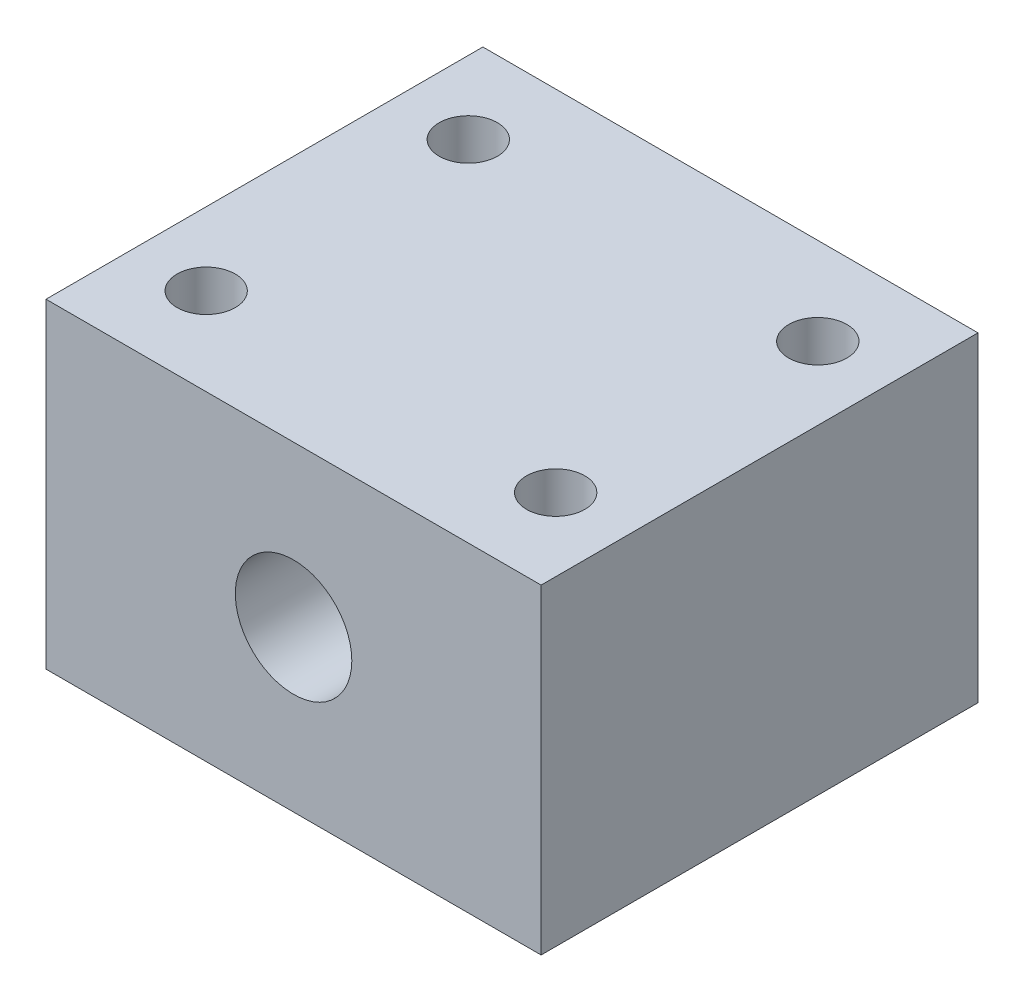
ISO-10303-21;
HEADER;
FILE_DESCRIPTION(('STEP AP214'),'2;1');
FILE_NAME('part.step','',(''),(''),'','','');
FILE_SCHEMA(('AUTOMOTIVE_DESIGN { 1 0 10303 214 1 1 1 1 }'));
ENDSEC;
DATA;
#1=APPLICATION_CONTEXT('core data for automotive mechanical design processes');
#2=APPLICATION_PROTOCOL_DEFINITION('international standard','automotive_design',2000,#1);
#3=PRODUCT_CONTEXT('',#1,'mechanical');
#4=PRODUCT('Part','Part','',(#3));
#5=PRODUCT_RELATED_PRODUCT_CATEGORY('part','',(#4));
#6=PRODUCT_DEFINITION_FORMATION('','',#4);
#7=PRODUCT_DEFINITION_CONTEXT('part definition',#1,'design');
#8=PRODUCT_DEFINITION('design','',#6,#7);
#9=PRODUCT_DEFINITION_SHAPE('','',#8);
#10=(LENGTH_UNIT() NAMED_UNIT(*) SI_UNIT(.MILLI.,.METRE.));
#11=(NAMED_UNIT(*) PLANE_ANGLE_UNIT() SI_UNIT($,.RADIAN.));
#12=(NAMED_UNIT(*) SI_UNIT($,.STERADIAN.) SOLID_ANGLE_UNIT());
#13=UNCERTAINTY_MEASURE_WITH_UNIT(LENGTH_MEASURE(1.E-05),#10,'distance_accuracy_value','');
#14=(GEOMETRIC_REPRESENTATION_CONTEXT(3) GLOBAL_UNCERTAINTY_ASSIGNED_CONTEXT((#13)) GLOBAL_UNIT_ASSIGNED_CONTEXT((#10,
#11,#12)) REPRESENTATION_CONTEXT('',''));
#15=CARTESIAN_POINT('',(0.,0.,0.));
#16=DIRECTION('',(0.,0.,1.));
#17=DIRECTION('',(1.,0.,0.));
#18=AXIS2_PLACEMENT_3D('',#15,#16,#17);
#19=CARTESIAN_POINT('',(0.,0.,30.));
#20=DIRECTION('',(0.,0.,-1.));
#21=DIRECTION('',(-1.,0.,0.));
#22=AXIS2_PLACEMENT_3D('',#19,#20,#21);
#23=PLANE('',#22);
#24=DIRECTION('',(0.,-1.,0.));
#25=VECTOR('',#24,1.);
#26=CARTESIAN_POINT('',(0.,0.,30.));
#27=LINE('',#26,#25);
#28=CARTESIAN_POINT('',(0.,22.,30.));
#29=VERTEX_POINT('',#28);
#30=CARTESIAN_POINT('',(0.,0.,30.));
#31=VERTEX_POINT('',#30);
#32=EDGE_CURVE('E84',#29,#31,#27,.T.);
#33=ORIENTED_EDGE('',*,*,#32,.T.);
#34=DIRECTION('',(1.,0.,0.));
#35=VECTOR('',#34,1.);
#36=CARTESIAN_POINT('',(0.,0.,30.));
#37=LINE('',#36,#35);
#38=CARTESIAN_POINT('',(34.,0.,30.));
#39=VERTEX_POINT('',#38);
#40=EDGE_CURVE('E79',#31,#39,#37,.T.);
#41=ORIENTED_EDGE('',*,*,#40,.T.);
#42=DIRECTION('',(0.,1.,0.));
#43=VECTOR('',#42,1.);
#44=CARTESIAN_POINT('',(34.,0.,30.));
#45=LINE('',#44,#43);
#46=CARTESIAN_POINT('',(34.,22.,30.));
#47=VERTEX_POINT('',#46);
#48=EDGE_CURVE('E82',#39,#47,#45,.T.);
#49=ORIENTED_EDGE('',*,*,#48,.T.);
#50=DIRECTION('',(-1.,0.,0.));
#51=VECTOR('',#50,1.);
#52=CARTESIAN_POINT('',(0.,22.,30.));
#53=LINE('',#52,#51);
#54=EDGE_CURVE('E49',#47,#29,#53,.T.);
#55=ORIENTED_EDGE('',*,*,#54,.T.);
#56=EDGE_LOOP('',(#33,#41,#49,#55));
#57=FACE_BOUND('',#56,.T.);
#58=CARTESIAN_POINT('',(17.,11.,30.));
#59=DIRECTION('',(0.,0.,1.));
#60=DIRECTION('',(1.,0.,0.));
#61=AXIS2_PLACEMENT_3D('',#58,#59,#60);
#62=CIRCLE('',#61,4.);
#63=CARTESIAN_POINT('',(21.,11.,30.));
#64=VERTEX_POINT('',#63);
#65=EDGE_CURVE('E99',#64,#64,#62,.T.);
#66=ORIENTED_EDGE('',*,*,#65,.F.);
#67=EDGE_LOOP('',(#66));
#68=FACE_BOUND('',#67,.T.);
#69=ADVANCED_FACE('F32',(#57,#68),#23,.F.);
#70=CARTESIAN_POINT('',(0.,0.,0.));
#71=DIRECTION('',(0.,0.,-1.));
#72=DIRECTION('',(-1.,0.,0.));
#73=AXIS2_PLACEMENT_3D('',#70,#71,#72);
#74=PLANE('',#73);
#75=DIRECTION('',(0.,-1.,0.));
#76=VECTOR('',#75,1.);
#77=CARTESIAN_POINT('',(0.,0.,0.));
#78=LINE('',#77,#76);
#79=CARTESIAN_POINT('',(0.,22.,0.));
#80=VERTEX_POINT('',#79);
#81=CARTESIAN_POINT('',(0.,0.,0.));
#82=VERTEX_POINT('',#81);
#83=EDGE_CURVE('E96',#80,#82,#78,.T.);
#84=ORIENTED_EDGE('',*,*,#83,.F.);
#85=DIRECTION('',(-1.,0.,0.));
#86=VECTOR('',#85,1.);
#87=CARTESIAN_POINT('',(0.,22.,0.));
#88=LINE('',#87,#86);
#89=CARTESIAN_POINT('',(34.,22.,0.));
#90=VERTEX_POINT('',#89);
#91=EDGE_CURVE('E72',#90,#80,#88,.T.);
#92=ORIENTED_EDGE('',*,*,#91,.F.);
#93=DIRECTION('',(0.,1.,0.));
#94=VECTOR('',#93,1.);
#95=CARTESIAN_POINT('',(34.,0.,0.));
#96=LINE('',#95,#94);
#97=CARTESIAN_POINT('',(34.,0.,0.));
#98=VERTEX_POINT('',#97);
#99=EDGE_CURVE('E66',#98,#90,#96,.T.);
#100=ORIENTED_EDGE('',*,*,#99,.F.);
#101=DIRECTION('',(1.,0.,0.));
#102=VECTOR('',#101,1.);
#103=CARTESIAN_POINT('',(0.,0.,0.));
#104=LINE('',#103,#102);
#105=EDGE_CURVE('E88',#82,#98,#104,.T.);
#106=ORIENTED_EDGE('',*,*,#105,.F.);
#107=EDGE_LOOP('',(#84,#92,#100,#106));
#108=FACE_BOUND('',#107,.T.);
#109=CARTESIAN_POINT('',(17.,11.,0.));
#110=DIRECTION('',(0.,0.,1.));
#111=DIRECTION('',(1.,0.,0.));
#112=AXIS2_PLACEMENT_3D('',#109,#110,#111);
#113=CIRCLE('',#112,4.);
#114=CARTESIAN_POINT('',(21.,11.,0.));
#115=VERTEX_POINT('',#114);
#116=EDGE_CURVE('E111',#115,#115,#113,.T.);
#117=ORIENTED_EDGE('',*,*,#116,.T.);
#118=EDGE_LOOP('',(#117));
#119=FACE_BOUND('',#118,.T.);
#120=ADVANCED_FACE('F107',(#108,#119),#74,.T.);
#121=CARTESIAN_POINT('',(0.,0.,30.));
#122=DIRECTION('',(1.,0.,0.));
#123=DIRECTION('',(0.,0.,-1.));
#124=AXIS2_PLACEMENT_3D('',#121,#122,#123);
#125=PLANE('',#124);
#126=ORIENTED_EDGE('',*,*,#83,.T.);
#127=DIRECTION('',(0.,0.,-1.));
#128=VECTOR('',#127,1.);
#129=CARTESIAN_POINT('',(0.,0.,30.));
#130=LINE('',#129,#128);
#131=EDGE_CURVE('E11',#31,#82,#130,.T.);
#132=ORIENTED_EDGE('',*,*,#131,.F.);
#133=ORIENTED_EDGE('',*,*,#32,.F.);
#134=DIRECTION('',(0.,0.,-1.));
#135=VECTOR('',#134,1.);
#136=CARTESIAN_POINT('',(0.,22.,30.));
#137=LINE('',#136,#135);
#138=EDGE_CURVE('E92',#29,#80,#137,.T.);
#139=ORIENTED_EDGE('',*,*,#138,.T.);
#140=EDGE_LOOP('',(#126,#132,#133,#139));
#141=FACE_BOUND('',#140,.T.);
#142=ADVANCED_FACE('F34',(#141),#125,.F.);
#143=CARTESIAN_POINT('',(0.,0.,30.));
#144=DIRECTION('',(0.,1.,0.));
#145=DIRECTION('',(0.,0.,1.));
#146=AXIS2_PLACEMENT_3D('',#143,#144,#145);
#147=PLANE('',#146);
#148=CARTESIAN_POINT('',(29.,0.,24.));
#149=DIRECTION('',(0.,1.,0.));
#150=DIRECTION('',(0.,0.,1.));
#151=AXIS2_PLACEMENT_3D('',#148,#149,#150);
#152=CIRCLE('',#151,2.);
#153=CARTESIAN_POINT('',(29.,0.,26.));
#154=VERTEX_POINT('',#153);
#155=EDGE_CURVE('E132',#154,#154,#152,.T.);
#156=ORIENTED_EDGE('',*,*,#155,.T.);
#157=EDGE_LOOP('',(#156));
#158=FACE_BOUND('',#157,.T.);
#159=CARTESIAN_POINT('',(29.,0.,6.));
#160=DIRECTION('',(0.,1.,0.));
#161=DIRECTION('',(0.,0.,1.));
#162=AXIS2_PLACEMENT_3D('',#159,#160,#161);
#163=CIRCLE('',#162,2.);
#164=CARTESIAN_POINT('',(29.,0.,8.00000000000001));
#165=VERTEX_POINT('',#164);
#166=EDGE_CURVE('E126',#165,#165,#163,.T.);
#167=ORIENTED_EDGE('',*,*,#166,.T.);
#168=EDGE_LOOP('',(#167));
#169=FACE_BOUND('',#168,.T.);
#170=CARTESIAN_POINT('',(5.,0.,6.));
#171=DIRECTION('',(0.,1.,0.));
#172=DIRECTION('',(0.,0.,1.));
#173=AXIS2_PLACEMENT_3D('',#170,#171,#172);
#174=CIRCLE('',#173,2.);
#175=CARTESIAN_POINT('',(5.,0.,8.));
#176=VERTEX_POINT('',#175);
#177=EDGE_CURVE('E120',#176,#176,#174,.T.);
#178=ORIENTED_EDGE('',*,*,#177,.T.);
#179=EDGE_LOOP('',(#178));
#180=FACE_BOUND('',#179,.T.);
#181=CARTESIAN_POINT('',(5.,0.,24.));
#182=DIRECTION('',(0.,1.,0.));
#183=DIRECTION('',(0.,0.,1.));
#184=AXIS2_PLACEMENT_3D('',#181,#182,#183);
#185=CIRCLE('',#184,2.);
#186=CARTESIAN_POINT('',(5.,0.,26.));
#187=VERTEX_POINT('',#186);
#188=EDGE_CURVE('E114',#187,#187,#185,.T.);
#189=ORIENTED_EDGE('',*,*,#188,.T.);
#190=EDGE_LOOP('',(#189));
#191=FACE_BOUND('',#190,.T.);
#192=ORIENTED_EDGE('',*,*,#105,.T.);
#193=DIRECTION('',(0.,0.,-1.));
#194=VECTOR('',#193,1.);
#195=CARTESIAN_POINT('',(34.,0.,30.));
#196=LINE('',#195,#194);
#197=EDGE_CURVE('E41',#39,#98,#196,.T.);
#198=ORIENTED_EDGE('',*,*,#197,.F.);
#199=ORIENTED_EDGE('',*,*,#40,.F.);
#200=ORIENTED_EDGE('',*,*,#131,.T.);
#201=EDGE_LOOP('',(#192,#198,#199,#200));
#202=FACE_BOUND('',#201,.T.);
#203=ADVANCED_FACE('F87',(#158,#169,#180,#191,#202),#147,.F.);
#204=CARTESIAN_POINT('',(34.,0.,30.));
#205=DIRECTION('',(-1.,0.,0.));
#206=DIRECTION('',(0.,0.,1.));
#207=AXIS2_PLACEMENT_3D('',#204,#205,#206);
#208=PLANE('',#207);
#209=ORIENTED_EDGE('',*,*,#99,.T.);
#210=DIRECTION('',(0.,0.,-1.));
#211=VECTOR('',#210,1.);
#212=CARTESIAN_POINT('',(34.,22.,30.));
#213=LINE('',#212,#211);
#214=EDGE_CURVE('E89',#47,#90,#213,.T.);
#215=ORIENTED_EDGE('',*,*,#214,.F.);
#216=ORIENTED_EDGE('',*,*,#48,.F.);
#217=ORIENTED_EDGE('',*,*,#197,.T.);
#218=EDGE_LOOP('',(#209,#215,#216,#217));
#219=FACE_BOUND('',#218,.T.);
#220=ADVANCED_FACE('F90',(#219),#208,.F.);
#221=CARTESIAN_POINT('',(0.,22.,30.));
#222=DIRECTION('',(0.,-1.,0.));
#223=DIRECTION('',(0.,0.,-1.));
#224=AXIS2_PLACEMENT_3D('',#221,#222,#223);
#225=PLANE('',#224);
#226=CARTESIAN_POINT('',(29.,22.,24.));
#227=DIRECTION('',(0.,1.,0.));
#228=DIRECTION('',(0.,0.,1.));
#229=AXIS2_PLACEMENT_3D('',#226,#227,#228);
#230=CIRCLE('',#229,2.);
#231=CARTESIAN_POINT('',(29.,22.,26.));
#232=VERTEX_POINT('',#231);
#233=EDGE_CURVE('E135',#232,#232,#230,.T.);
#234=ORIENTED_EDGE('',*,*,#233,.F.);
#235=EDGE_LOOP('',(#234));
#236=FACE_BOUND('',#235,.T.);
#237=CARTESIAN_POINT('',(29.,22.,6.));
#238=DIRECTION('',(0.,1.,0.));
#239=DIRECTION('',(0.,0.,1.));
#240=AXIS2_PLACEMENT_3D('',#237,#238,#239);
#241=CIRCLE('',#240,2.);
#242=CARTESIAN_POINT('',(29.,22.,8.00000000000001));
#243=VERTEX_POINT('',#242);
#244=EDGE_CURVE('E129',#243,#243,#241,.T.);
#245=ORIENTED_EDGE('',*,*,#244,.F.);
#246=EDGE_LOOP('',(#245));
#247=FACE_BOUND('',#246,.T.);
#248=CARTESIAN_POINT('',(5.,22.,6.));
#249=DIRECTION('',(0.,1.,0.));
#250=DIRECTION('',(0.,0.,1.));
#251=AXIS2_PLACEMENT_3D('',#248,#249,#250);
#252=CIRCLE('',#251,2.);
#253=CARTESIAN_POINT('',(5.,22.,8.));
#254=VERTEX_POINT('',#253);
#255=EDGE_CURVE('E123',#254,#254,#252,.T.);
#256=ORIENTED_EDGE('',*,*,#255,.F.);
#257=EDGE_LOOP('',(#256));
#258=FACE_BOUND('',#257,.T.);
#259=CARTESIAN_POINT('',(5.,22.,24.));
#260=DIRECTION('',(0.,1.,0.));
#261=DIRECTION('',(0.,0.,1.));
#262=AXIS2_PLACEMENT_3D('',#259,#260,#261);
#263=CIRCLE('',#262,2.);
#264=CARTESIAN_POINT('',(5.,22.,26.));
#265=VERTEX_POINT('',#264);
#266=EDGE_CURVE('E117',#265,#265,#263,.T.);
#267=ORIENTED_EDGE('',*,*,#266,.F.);
#268=EDGE_LOOP('',(#267));
#269=FACE_BOUND('',#268,.T.);
#270=ORIENTED_EDGE('',*,*,#91,.T.);
#271=ORIENTED_EDGE('',*,*,#138,.F.);
#272=ORIENTED_EDGE('',*,*,#54,.F.);
#273=ORIENTED_EDGE('',*,*,#214,.T.);
#274=EDGE_LOOP('',(#270,#271,#272,#273));
#275=FACE_BOUND('',#274,.T.);
#276=ADVANCED_FACE('F104',(#236,#247,#258,#269,#275),#225,.F.);
#277=CARTESIAN_POINT('',(17.,11.,30.));
#278=DIRECTION('',(0.,0.,-1.));
#279=DIRECTION('',(-1.,0.,0.));
#280=AXIS2_PLACEMENT_3D('',#277,#278,#279);
#281=CYLINDRICAL_SURFACE('',#280,4.);
#282=ORIENTED_EDGE('',*,*,#65,.T.);
#283=EDGE_LOOP('',(#282));
#284=FACE_BOUND('',#283,.T.);
#285=ORIENTED_EDGE('',*,*,#116,.F.);
#286=EDGE_LOOP('',(#285));
#287=FACE_BOUND('',#286,.T.);
#288=ADVANCED_FACE('F152',(#284,#287),#281,.F.);
#289=CARTESIAN_POINT('',(5.,0.,24.));
#290=DIRECTION('',(0.,1.,0.));
#291=DIRECTION('',(0.,0.,1.));
#292=AXIS2_PLACEMENT_3D('',#289,#290,#291);
#293=CYLINDRICAL_SURFACE('',#292,2.);
#294=ORIENTED_EDGE('',*,*,#188,.F.);
#295=EDGE_LOOP('',(#294));
#296=FACE_BOUND('',#295,.T.);
#297=ORIENTED_EDGE('',*,*,#266,.T.);
#298=EDGE_LOOP('',(#297));
#299=FACE_BOUND('',#298,.T.);
#300=ADVANCED_FACE('F160',(#296,#299),#293,.F.);
#301=CARTESIAN_POINT('',(5.,0.,6.));
#302=DIRECTION('',(0.,1.,0.));
#303=DIRECTION('',(0.,0.,1.));
#304=AXIS2_PLACEMENT_3D('',#301,#302,#303);
#305=CYLINDRICAL_SURFACE('',#304,2.);
#306=ORIENTED_EDGE('',*,*,#177,.F.);
#307=EDGE_LOOP('',(#306));
#308=FACE_BOUND('',#307,.T.);
#309=ORIENTED_EDGE('',*,*,#255,.T.);
#310=EDGE_LOOP('',(#309));
#311=FACE_BOUND('',#310,.T.);
#312=ADVANCED_FACE('F162',(#308,#311),#305,.F.);
#313=CARTESIAN_POINT('',(29.,0.,6.));
#314=DIRECTION('',(0.,1.,0.));
#315=DIRECTION('',(0.,0.,1.));
#316=AXIS2_PLACEMENT_3D('',#313,#314,#315);
#317=CYLINDRICAL_SURFACE('',#316,2.);
#318=ORIENTED_EDGE('',*,*,#166,.F.);
#319=EDGE_LOOP('',(#318));
#320=FACE_BOUND('',#319,.T.);
#321=ORIENTED_EDGE('',*,*,#244,.T.);
#322=EDGE_LOOP('',(#321));
#323=FACE_BOUND('',#322,.T.);
#324=ADVANCED_FACE('F146',(#320,#323),#317,.F.);
#325=CARTESIAN_POINT('',(29.,0.,24.));
#326=DIRECTION('',(0.,1.,0.));
#327=DIRECTION('',(0.,0.,1.));
#328=AXIS2_PLACEMENT_3D('',#325,#326,#327);
#329=CYLINDRICAL_SURFACE('',#328,2.);
#330=ORIENTED_EDGE('',*,*,#155,.F.);
#331=EDGE_LOOP('',(#330));
#332=FACE_BOUND('',#331,.T.);
#333=ORIENTED_EDGE('',*,*,#233,.T.);
#334=EDGE_LOOP('',(#333));
#335=FACE_BOUND('',#334,.T.);
#336=ADVANCED_FACE('F143',(#332,#335),#329,.F.);
#337=CLOSED_SHELL('',(#69,#120,#142,#203,#220,#276,#288,#300,#312,#324,#336));
#338=MANIFOLD_SOLID_BREP('B2',#337);
#339=ADVANCED_BREP_SHAPE_REPRESENTATION('',(#18,#338),#14);
#340=SHAPE_DEFINITION_REPRESENTATION(#9,#339);
ENDSEC;
END-ISO-10303-21;
